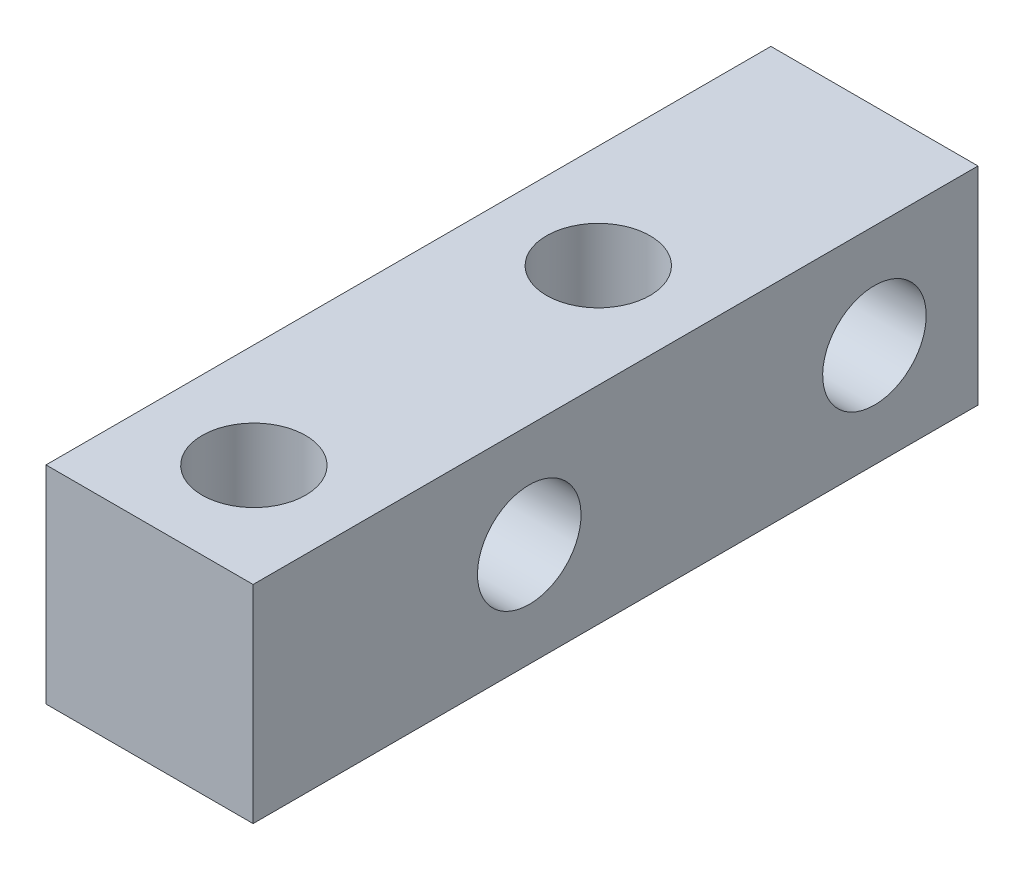
ISO-10303-21;
HEADER;
FILE_DESCRIPTION(('STEP AP214'),'2;1');
FILE_NAME('part.step','',(''),(''),'','','');
FILE_SCHEMA(('AUTOMOTIVE_DESIGN { 1 0 10303 214 1 1 1 1 }'));
ENDSEC;
DATA;
#1=APPLICATION_CONTEXT('core data for automotive mechanical design processes');
#2=APPLICATION_PROTOCOL_DEFINITION('international standard','automotive_design',2000,#1);
#3=PRODUCT_CONTEXT('',#1,'mechanical');
#4=PRODUCT('Part','Part','',(#3));
#5=PRODUCT_RELATED_PRODUCT_CATEGORY('part','',(#4));
#6=PRODUCT_DEFINITION_FORMATION('','',#4);
#7=PRODUCT_DEFINITION_CONTEXT('part definition',#1,'design');
#8=PRODUCT_DEFINITION('design','',#6,#7);
#9=PRODUCT_DEFINITION_SHAPE('','',#8);
#10=(LENGTH_UNIT() NAMED_UNIT(*) SI_UNIT(.MILLI.,.METRE.));
#11=(NAMED_UNIT(*) PLANE_ANGLE_UNIT() SI_UNIT($,.RADIAN.));
#12=(NAMED_UNIT(*) SI_UNIT($,.STERADIAN.) SOLID_ANGLE_UNIT());
#13=UNCERTAINTY_MEASURE_WITH_UNIT(LENGTH_MEASURE(1.E-05),#10,'distance_accuracy_value','');
#14=(GEOMETRIC_REPRESENTATION_CONTEXT(3) GLOBAL_UNCERTAINTY_ASSIGNED_CONTEXT((#13)) GLOBAL_UNIT_ASSIGNED_CONTEXT((#10,
#11,#12)) REPRESENTATION_CONTEXT('',''));
#15=CARTESIAN_POINT('',(0.,0.,0.));
#16=DIRECTION('',(0.,0.,1.));
#17=DIRECTION('',(1.,0.,0.));
#18=AXIS2_PLACEMENT_3D('',#15,#16,#17);
#19=CARTESIAN_POINT('',(3.,3.,21.));
#20=DIRECTION('',(-1.,0.,0.));
#21=DIRECTION('',(0.,-1.,0.));
#22=AXIS2_PLACEMENT_3D('',#19,#20,#21);
#23=PLANE('',#22);
#24=CARTESIAN_POINT('',(3.,0.,3.));
#25=DIRECTION('',(-1.,0.,0.));
#26=DIRECTION('',(0.,-1.,0.));
#27=AXIS2_PLACEMENT_3D('',#24,#25,#26);
#28=CIRCLE('',#27,1.5);
#29=CARTESIAN_POINT('',(3.,-1.5,3.));
#30=VERTEX_POINT('',#29);
#31=EDGE_CURVE('E117',#30,#30,#28,.T.);
#32=ORIENTED_EDGE('',*,*,#31,.T.);
#33=EDGE_LOOP('',(#32));
#34=FACE_BOUND('',#33,.T.);
#35=CARTESIAN_POINT('',(3.,0.,13.));
#36=DIRECTION('',(-1.,0.,0.));
#37=DIRECTION('',(0.,-1.,0.));
#38=AXIS2_PLACEMENT_3D('',#35,#36,#37);
#39=CIRCLE('',#38,1.5);
#40=CARTESIAN_POINT('',(3.,-1.5,13.));
#41=VERTEX_POINT('',#40);
#42=EDGE_CURVE('E150',#41,#41,#39,.T.);
#43=ORIENTED_EDGE('',*,*,#42,.T.);
#44=EDGE_LOOP('',(#43));
#45=FACE_BOUND('',#44,.T.);
#46=DIRECTION('',(0.,1.,0.));
#47=VECTOR('',#46,1.);
#48=CARTESIAN_POINT('',(3.,3.,0.));
#49=LINE('',#48,#47);
#50=CARTESIAN_POINT('',(3.,-3.,0.));
#51=VERTEX_POINT('',#50);
#52=CARTESIAN_POINT('',(3.,3.,0.));
#53=VERTEX_POINT('',#52);
#54=EDGE_CURVE('E113',#51,#53,#49,.T.);
#55=ORIENTED_EDGE('',*,*,#54,.T.);
#56=DIRECTION('',(0.,0.,-1.));
#57=VECTOR('',#56,1.);
#58=CARTESIAN_POINT('',(3.,3.,21.));
#59=LINE('',#58,#57);
#60=CARTESIAN_POINT('',(3.,3.,21.));
#61=VERTEX_POINT('',#60);
#62=EDGE_CURVE('E11',#61,#53,#59,.T.);
#63=ORIENTED_EDGE('',*,*,#62,.F.);
#64=DIRECTION('',(0.,1.,0.));
#65=VECTOR('',#64,1.);
#66=CARTESIAN_POINT('',(3.,3.,21.));
#67=LINE('',#66,#65);
#68=CARTESIAN_POINT('',(3.,-3.,21.));
#69=VERTEX_POINT('',#68);
#70=EDGE_CURVE('E96',#69,#61,#67,.T.);
#71=ORIENTED_EDGE('',*,*,#70,.F.);
#72=DIRECTION('',(0.,0.,-1.));
#73=VECTOR('',#72,1.);
#74=CARTESIAN_POINT('',(3.,-3.,21.));
#75=LINE('',#74,#73);
#76=EDGE_CURVE('E109',#69,#51,#75,.T.);
#77=ORIENTED_EDGE('',*,*,#76,.T.);
#78=EDGE_LOOP('',(#55,#63,#71,#77));
#79=FACE_BOUND('',#78,.T.);
#80=ADVANCED_FACE('F42',(#34,#45,#79),#23,.F.);
#81=CARTESIAN_POINT('',(-3.,3.,21.));
#82=DIRECTION('',(0.,-1.,0.));
#83=DIRECTION('',(0.,0.,-1.));
#84=AXIS2_PLACEMENT_3D('',#81,#82,#83);
#85=PLANE('',#84);
#86=CARTESIAN_POINT('',(0.0215040602113692,3.,18.));
#87=DIRECTION('',(0.,1.,0.));
#88=DIRECTION('',(0.,0.,1.));
#89=AXIS2_PLACEMENT_3D('',#86,#87,#88);
#90=CIRCLE('',#89,1.5);
#91=CARTESIAN_POINT('',(0.0215040602113692,3.,19.5));
#92=VERTEX_POINT('',#91);
#93=EDGE_CURVE('E130',#92,#92,#90,.T.);
#94=ORIENTED_EDGE('',*,*,#93,.F.);
#95=EDGE_LOOP('',(#94));
#96=FACE_BOUND('',#95,.T.);
#97=CARTESIAN_POINT('',(0.,3.,8.));
#98=DIRECTION('',(0.,1.,0.));
#99=DIRECTION('',(0.,0.,1.));
#100=AXIS2_PLACEMENT_3D('',#97,#98,#99);
#101=CIRCLE('',#100,1.5);
#102=CARTESIAN_POINT('',(0.,3.,9.5));
#103=VERTEX_POINT('',#102);
#104=EDGE_CURVE('E138',#103,#103,#101,.T.);
#105=ORIENTED_EDGE('',*,*,#104,.F.);
#106=EDGE_LOOP('',(#105));
#107=FACE_BOUND('',#106,.T.);
#108=DIRECTION('',(-1.,0.,0.));
#109=VECTOR('',#108,1.);
#110=CARTESIAN_POINT('',(-3.,3.,0.));
#111=LINE('',#110,#109);
#112=CARTESIAN_POINT('',(-3.,3.,0.));
#113=VERTEX_POINT('',#112);
#114=EDGE_CURVE('E101',#53,#113,#111,.T.);
#115=ORIENTED_EDGE('',*,*,#114,.T.);
#116=DIRECTION('',(0.,0.,-1.));
#117=VECTOR('',#116,1.);
#118=CARTESIAN_POINT('',(-3.,3.,21.));
#119=LINE('',#118,#117);
#120=CARTESIAN_POINT('',(-3.,3.,21.));
#121=VERTEX_POINT('',#120);
#122=EDGE_CURVE('E52',#121,#113,#119,.T.);
#123=ORIENTED_EDGE('',*,*,#122,.F.);
#124=DIRECTION('',(-1.,0.,0.));
#125=VECTOR('',#124,1.);
#126=CARTESIAN_POINT('',(-3.,3.,21.));
#127=LINE('',#126,#125);
#128=EDGE_CURVE('E91',#61,#121,#127,.T.);
#129=ORIENTED_EDGE('',*,*,#128,.F.);
#130=ORIENTED_EDGE('',*,*,#62,.T.);
#131=EDGE_LOOP('',(#115,#123,#129,#130));
#132=FACE_BOUND('',#131,.T.);
#133=ADVANCED_FACE('F100',(#96,#107,#132),#85,.F.);
#134=CARTESIAN_POINT('',(-3.,3.,21.));
#135=DIRECTION('',(1.,0.,0.));
#136=DIRECTION('',(0.,1.,0.));
#137=AXIS2_PLACEMENT_3D('',#134,#135,#136);
#138=PLANE('',#137);
#139=CARTESIAN_POINT('',(-3.,0.,3.));
#140=DIRECTION('',(-1.,0.,0.));
#141=DIRECTION('',(0.,-1.,0.));
#142=AXIS2_PLACEMENT_3D('',#139,#140,#141);
#143=CIRCLE('',#142,1.5);
#144=CARTESIAN_POINT('',(-3.,-1.5,3.));
#145=VERTEX_POINT('',#144);
#146=EDGE_CURVE('E146',#145,#145,#143,.T.);
#147=ORIENTED_EDGE('',*,*,#146,.F.);
#148=EDGE_LOOP('',(#147));
#149=FACE_BOUND('',#148,.T.);
#150=CARTESIAN_POINT('',(-3.,0.,13.));
#151=DIRECTION('',(-1.,0.,0.));
#152=DIRECTION('',(0.,-1.,0.));
#153=AXIS2_PLACEMENT_3D('',#150,#151,#152);
#154=CIRCLE('',#153,1.5);
#155=CARTESIAN_POINT('',(-3.,-1.5,13.));
#156=VERTEX_POINT('',#155);
#157=EDGE_CURVE('E136',#156,#156,#154,.T.);
#158=ORIENTED_EDGE('',*,*,#157,.F.);
#159=EDGE_LOOP('',(#158));
#160=FACE_BOUND('',#159,.T.);
#161=DIRECTION('',(0.,-1.,0.));
#162=VECTOR('',#161,1.);
#163=CARTESIAN_POINT('',(-3.,3.,0.));
#164=LINE('',#163,#162);
#165=CARTESIAN_POINT('',(-3.,-3.,0.));
#166=VERTEX_POINT('',#165);
#167=EDGE_CURVE('E78',#113,#166,#164,.T.);
#168=ORIENTED_EDGE('',*,*,#167,.T.);
#169=DIRECTION('',(0.,0.,-1.));
#170=VECTOR('',#169,1.);
#171=CARTESIAN_POINT('',(-3.,-3.,21.));
#172=LINE('',#171,#170);
#173=CARTESIAN_POINT('',(-3.,-3.,21.));
#174=VERTEX_POINT('',#173);
#175=EDGE_CURVE('E103',#174,#166,#172,.T.);
#176=ORIENTED_EDGE('',*,*,#175,.F.);
#177=DIRECTION('',(0.,-1.,0.));
#178=VECTOR('',#177,1.);
#179=CARTESIAN_POINT('',(-3.,3.,21.));
#180=LINE('',#179,#178);
#181=EDGE_CURVE('E94',#121,#174,#180,.T.);
#182=ORIENTED_EDGE('',*,*,#181,.F.);
#183=ORIENTED_EDGE('',*,*,#122,.T.);
#184=EDGE_LOOP('',(#168,#176,#182,#183));
#185=FACE_BOUND('',#184,.T.);
#186=ADVANCED_FACE('F105',(#149,#160,#185),#138,.F.);
#187=CARTESIAN_POINT('',(-3.,-3.,21.));
#188=DIRECTION('',(0.,1.,0.));
#189=DIRECTION('',(0.,0.,1.));
#190=AXIS2_PLACEMENT_3D('',#187,#188,#189);
#191=PLANE('',#190);
#192=CARTESIAN_POINT('',(0.0215040602113692,-3.,18.));
#193=DIRECTION('',(0.,1.,0.));
#194=DIRECTION('',(0.,0.,1.));
#195=AXIS2_PLACEMENT_3D('',#192,#193,#194);
#196=CIRCLE('',#195,1.5);
#197=CARTESIAN_POINT('',(0.0215040602113692,-3.,19.5));
#198=VERTEX_POINT('',#197);
#199=EDGE_CURVE('E45',#198,#198,#196,.T.);
#200=ORIENTED_EDGE('',*,*,#199,.T.);
#201=EDGE_LOOP('',(#200));
#202=FACE_BOUND('',#201,.T.);
#203=CARTESIAN_POINT('',(0.,-3.,8.));
#204=DIRECTION('',(0.,1.,0.));
#205=DIRECTION('',(0.,0.,1.));
#206=AXIS2_PLACEMENT_3D('',#203,#204,#205);
#207=CIRCLE('',#206,1.5);
#208=CARTESIAN_POINT('',(0.,-3.,9.5));
#209=VERTEX_POINT('',#208);
#210=EDGE_CURVE('E127',#209,#209,#207,.T.);
#211=ORIENTED_EDGE('',*,*,#210,.T.);
#212=EDGE_LOOP('',(#211));
#213=FACE_BOUND('',#212,.T.);
#214=DIRECTION('',(1.,0.,0.));
#215=VECTOR('',#214,1.);
#216=CARTESIAN_POINT('',(-3.,-3.,0.));
#217=LINE('',#216,#215);
#218=EDGE_CURVE('E84',#166,#51,#217,.T.);
#219=ORIENTED_EDGE('',*,*,#218,.T.);
#220=ORIENTED_EDGE('',*,*,#76,.F.);
#221=DIRECTION('',(1.,0.,0.));
#222=VECTOR('',#221,1.);
#223=CARTESIAN_POINT('',(-3.,-3.,21.));
#224=LINE('',#223,#222);
#225=EDGE_CURVE('E61',#174,#69,#224,.T.);
#226=ORIENTED_EDGE('',*,*,#225,.F.);
#227=ORIENTED_EDGE('',*,*,#175,.T.);
#228=EDGE_LOOP('',(#219,#220,#226,#227));
#229=FACE_BOUND('',#228,.T.);
#230=ADVANCED_FACE('F188',(#202,#213,#229),#191,.F.);
#231=CARTESIAN_POINT('',(0.,0.,21.));
#232=DIRECTION('',(0.,0.,1.));
#233=DIRECTION('',(1.,0.,0.));
#234=AXIS2_PLACEMENT_3D('',#231,#232,#233);
#235=PLANE('',#234);
#236=ORIENTED_EDGE('',*,*,#70,.T.);
#237=ORIENTED_EDGE('',*,*,#128,.T.);
#238=ORIENTED_EDGE('',*,*,#181,.T.);
#239=ORIENTED_EDGE('',*,*,#225,.T.);
#240=EDGE_LOOP('',(#236,#237,#238,#239));
#241=FACE_BOUND('',#240,.T.);
#242=ADVANCED_FACE('F92',(#241),#235,.T.);
#243=CARTESIAN_POINT('',(0.,0.,0.));
#244=DIRECTION('',(0.,0.,1.));
#245=DIRECTION('',(1.,0.,0.));
#246=AXIS2_PLACEMENT_3D('',#243,#244,#245);
#247=PLANE('',#246);
#248=ORIENTED_EDGE('',*,*,#54,.F.);
#249=ORIENTED_EDGE('',*,*,#218,.F.);
#250=ORIENTED_EDGE('',*,*,#167,.F.);
#251=ORIENTED_EDGE('',*,*,#114,.F.);
#252=EDGE_LOOP('',(#248,#249,#250,#251));
#253=FACE_BOUND('',#252,.T.);
#254=ADVANCED_FACE('F177',(#253),#247,.F.);
#255=CARTESIAN_POINT('',(18.,0.,13.));
#256=DIRECTION('',(-1.,0.,0.));
#257=DIRECTION('',(0.,-1.,0.));
#258=AXIS2_PLACEMENT_3D('',#255,#256,#257);
#259=CYLINDRICAL_SURFACE('',#258,1.5);
#260=ORIENTED_EDGE('',*,*,#157,.T.);
#261=EDGE_LOOP('',(#260));
#262=FACE_BOUND('',#261,.T.);
#263=ORIENTED_EDGE('',*,*,#42,.F.);
#264=EDGE_LOOP('',(#263));
#265=FACE_BOUND('',#264,.T.);
#266=ADVANCED_FACE('F167',(#262,#265),#259,.F.);
#267=CARTESIAN_POINT('',(18.,0.,3.));
#268=DIRECTION('',(-1.,0.,0.));
#269=DIRECTION('',(0.,-1.,0.));
#270=AXIS2_PLACEMENT_3D('',#267,#268,#269);
#271=CYLINDRICAL_SURFACE('',#270,1.5);
#272=ORIENTED_EDGE('',*,*,#146,.T.);
#273=EDGE_LOOP('',(#272));
#274=FACE_BOUND('',#273,.T.);
#275=ORIENTED_EDGE('',*,*,#31,.F.);
#276=EDGE_LOOP('',(#275));
#277=FACE_BOUND('',#276,.T.);
#278=ADVANCED_FACE('F164',(#274,#277),#271,.F.);
#279=CARTESIAN_POINT('',(0.,-18.,8.));
#280=DIRECTION('',(0.,1.,0.));
#281=DIRECTION('',(0.,0.,1.));
#282=AXIS2_PLACEMENT_3D('',#279,#280,#281);
#283=CYLINDRICAL_SURFACE('',#282,1.5);
#284=ORIENTED_EDGE('',*,*,#104,.T.);
#285=EDGE_LOOP('',(#284));
#286=FACE_BOUND('',#285,.T.);
#287=ORIENTED_EDGE('',*,*,#210,.F.);
#288=EDGE_LOOP('',(#287));
#289=FACE_BOUND('',#288,.T.);
#290=ADVANCED_FACE('F166',(#286,#289),#283,.F.);
#291=CARTESIAN_POINT('',(0.0215040602113692,-18.,18.));
#292=DIRECTION('',(0.,1.,0.));
#293=DIRECTION('',(0.,0.,1.));
#294=AXIS2_PLACEMENT_3D('',#291,#292,#293);
#295=CYLINDRICAL_SURFACE('',#294,1.5);
#296=ORIENTED_EDGE('',*,*,#93,.T.);
#297=EDGE_LOOP('',(#296));
#298=FACE_BOUND('',#297,.T.);
#299=ORIENTED_EDGE('',*,*,#199,.F.);
#300=EDGE_LOOP('',(#299));
#301=FACE_BOUND('',#300,.T.);
#302=ADVANCED_FACE('F174',(#298,#301),#295,.F.);
#303=CLOSED_SHELL('',(#80,#133,#186,#230,#242,#254,#266,#278,#290,#302));
#304=MANIFOLD_SOLID_BREP('B2',#303);
#305=ADVANCED_BREP_SHAPE_REPRESENTATION('',(#18,#304),#14);
#306=SHAPE_DEFINITION_REPRESENTATION(#9,#305);
ENDSEC;
END-ISO-10303-21;
